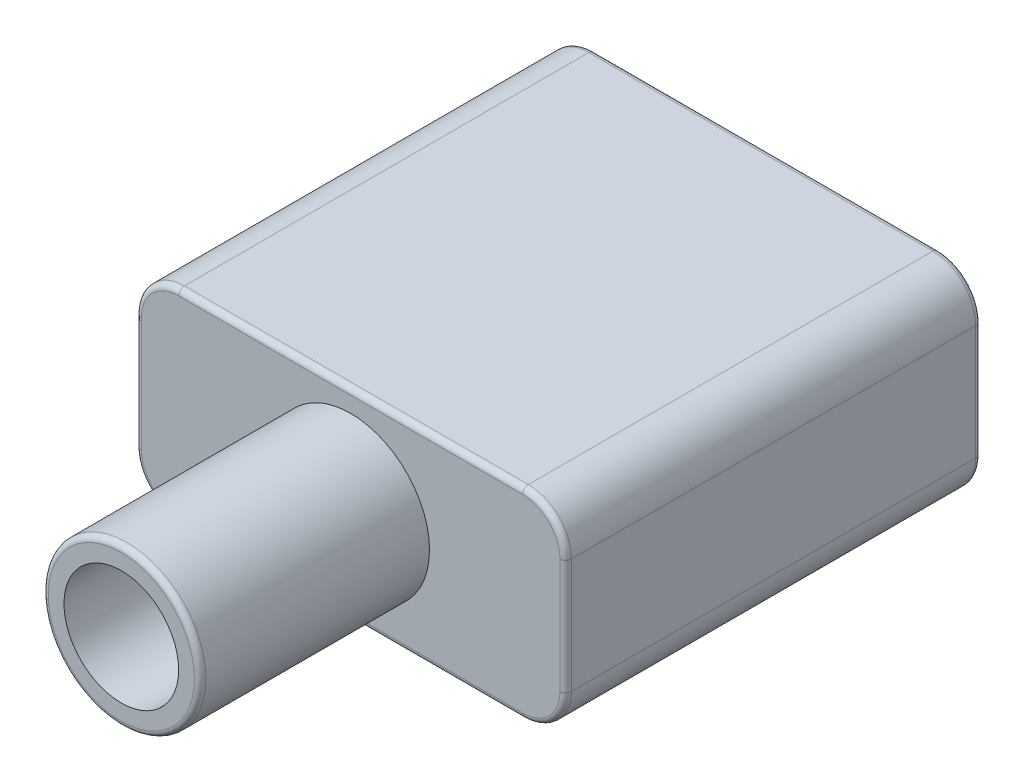
ISO-10303-21;
HEADER;
FILE_DESCRIPTION(('STEP AP214'),'2;1');
FILE_NAME('part.step','',(''),(''),'','','');
FILE_SCHEMA(('AUTOMOTIVE_DESIGN { 1 0 10303 214 1 1 1 1 }'));
ENDSEC;
DATA;
#1=APPLICATION_CONTEXT('core data for automotive mechanical design processes');
#2=APPLICATION_PROTOCOL_DEFINITION('international standard','automotive_design',2000,#1);
#3=PRODUCT_CONTEXT('',#1,'mechanical');
#4=PRODUCT('Part','Part','',(#3));
#5=PRODUCT_RELATED_PRODUCT_CATEGORY('part','',(#4));
#6=PRODUCT_DEFINITION_FORMATION('','',#4);
#7=PRODUCT_DEFINITION_CONTEXT('part definition',#1,'design');
#8=PRODUCT_DEFINITION('design','',#6,#7);
#9=PRODUCT_DEFINITION_SHAPE('','',#8);
#10=(LENGTH_UNIT() NAMED_UNIT(*) SI_UNIT(.MILLI.,.METRE.));
#11=(NAMED_UNIT(*) PLANE_ANGLE_UNIT() SI_UNIT($,.RADIAN.));
#12=(NAMED_UNIT(*) SI_UNIT($,.STERADIAN.) SOLID_ANGLE_UNIT());
#13=UNCERTAINTY_MEASURE_WITH_UNIT(LENGTH_MEASURE(1.E-05),#10,'distance_accuracy_value','');
#14=(GEOMETRIC_REPRESENTATION_CONTEXT(3) GLOBAL_UNCERTAINTY_ASSIGNED_CONTEXT((#13)) GLOBAL_UNIT_ASSIGNED_CONTEXT((#10,
#11,#12)) REPRESENTATION_CONTEXT('',''));
#15=CARTESIAN_POINT('',(0.,0.,0.));
#16=DIRECTION('',(0.,0.,1.));
#17=DIRECTION('',(1.,0.,0.));
#18=AXIS2_PLACEMENT_3D('',#15,#16,#17);
#19=CARTESIAN_POINT('',(7.5,3.5,9.));
#20=DIRECTION('',(0.,0.,-1.));
#21=DIRECTION('',(-1.,0.,0.));
#22=AXIS2_PLACEMENT_3D('',#19,#20,#21);
#23=CYLINDRICAL_SURFACE('',#22,2.);
#24=CARTESIAN_POINT('',(7.5,3.5,9.));
#25=DIRECTION('',(0.,0.,1.));
#26=DIRECTION('',(1.,0.,0.));
#27=AXIS2_PLACEMENT_3D('',#24,#25,#26);
#28=CIRCLE('',#27,2.);
#29=CARTESIAN_POINT('',(9.5,3.5,9.));
#30=VERTEX_POINT('',#29);
#31=EDGE_CURVE('E241',#30,#30,#28,.T.);
#32=ORIENTED_EDGE('',*,*,#31,.T.);
#33=EDGE_LOOP('',(#32));
#34=FACE_BOUND('',#33,.T.);
#35=CARTESIAN_POINT('',(7.5,3.5,0.));
#36=DIRECTION('',(0.,0.,1.));
#37=DIRECTION('',(1.,0.,0.));
#38=AXIS2_PLACEMENT_3D('',#35,#36,#37);
#39=CIRCLE('',#38,2.);
#40=CARTESIAN_POINT('',(9.5,3.5,0.));
#41=VERTEX_POINT('',#40);
#42=EDGE_CURVE('E240',#41,#41,#39,.T.);
#43=ORIENTED_EDGE('',*,*,#42,.F.);
#44=EDGE_LOOP('',(#43));
#45=FACE_BOUND('',#44,.T.);
#46=ADVANCED_FACE('F35',(#34,#45),#23,.F.);
#47=CARTESIAN_POINT('',(7.5,3.5,9.));
#48=DIRECTION('',(0.,0.,-1.));
#49=DIRECTION('',(-1.,0.,0.));
#50=AXIS2_PLACEMENT_3D('',#47,#48,#49);
#51=CYLINDRICAL_SURFACE('',#50,2.75);
#52=CARTESIAN_POINT('',(7.5,3.5,8.8));
#53=DIRECTION('',(0.,0.,1.));
#54=DIRECTION('',(1.,0.,0.));
#55=AXIS2_PLACEMENT_3D('',#52,#53,#54);
#56=CIRCLE('',#55,2.75);
#57=CARTESIAN_POINT('',(10.25,3.5,8.8));
#58=VERTEX_POINT('',#57);
#59=EDGE_CURVE('E11',#58,#58,#56,.F.);
#60=ORIENTED_EDGE('',*,*,#59,.T.);
#61=EDGE_LOOP('',(#60));
#62=FACE_BOUND('',#61,.T.);
#63=CARTESIAN_POINT('',(7.5,3.5,0.999999999999999));
#64=DIRECTION('',(0.,0.,1.));
#65=DIRECTION('',(1.,0.,0.));
#66=AXIS2_PLACEMENT_3D('',#63,#64,#65);
#67=CIRCLE('',#66,2.75);
#68=CARTESIAN_POINT('',(10.25,3.5,0.999999999999999));
#69=VERTEX_POINT('',#68);
#70=EDGE_CURVE('E244',#69,#69,#67,.T.);
#71=ORIENTED_EDGE('',*,*,#70,.T.);
#72=EDGE_LOOP('',(#71));
#73=FACE_BOUND('',#72,.T.);
#74=ADVANCED_FACE('F444',(#62,#73),#51,.T.);
#75=CARTESIAN_POINT('',(0.,0.,9.));
#76=DIRECTION('',(0.,0.,1.));
#77=DIRECTION('',(1.,0.,0.));
#78=AXIS2_PLACEMENT_3D('',#75,#76,#77);
#79=PLANE('',#78);
#80=CARTESIAN_POINT('',(7.5,3.5,9.));
#81=DIRECTION('',(0.,0.,1.));
#82=DIRECTION('',(1.,0.,0.));
#83=AXIS2_PLACEMENT_3D('',#80,#81,#82);
#84=CIRCLE('',#83,2.55);
#85=CARTESIAN_POINT('',(10.05,3.5,9.));
#86=VERTEX_POINT('',#85);
#87=EDGE_CURVE('E44',#86,#86,#84,.T.);
#88=ORIENTED_EDGE('',*,*,#87,.T.);
#89=EDGE_LOOP('',(#88));
#90=FACE_BOUND('',#89,.T.);
#91=ORIENTED_EDGE('',*,*,#31,.F.);
#92=EDGE_LOOP('',(#91));
#93=FACE_BOUND('',#92,.T.);
#94=ADVANCED_FACE('F446',(#90,#93),#79,.T.);
#95=CARTESIAN_POINT('',(0.,0.,0.));
#96=DIRECTION('',(0.,0.,1.));
#97=DIRECTION('',(1.,0.,0.));
#98=AXIS2_PLACEMENT_3D('',#95,#96,#97);
#99=PLANE('',#98);
#100=DIRECTION('',(1.,0.,0.));
#101=VECTOR('',#100,1.);
#102=CARTESIAN_POINT('',(0.,1.15,0.));
#103=LINE('',#102,#101);
#104=CARTESIAN_POINT('',(1.4,1.15,0.));
#105=VERTEX_POINT('',#104);
#106=CARTESIAN_POINT('',(13.6,1.15,0.));
#107=VERTEX_POINT('',#106);
#108=EDGE_CURVE('E199',#105,#107,#103,.T.);
#109=ORIENTED_EDGE('',*,*,#108,.F.);
#110=DIRECTION('',(0.,1.,0.));
#111=VECTOR('',#110,1.);
#112=CARTESIAN_POINT('',(1.4,0.,0.));
#113=LINE('',#112,#111);
#114=CARTESIAN_POINT('',(1.4,5.85,0.));
#115=VERTEX_POINT('',#114);
#116=EDGE_CURVE('E207',#105,#115,#113,.T.);
#117=ORIENTED_EDGE('',*,*,#116,.T.);
#118=DIRECTION('',(1.,0.,0.));
#119=VECTOR('',#118,1.);
#120=CARTESIAN_POINT('',(0.,5.85,0.));
#121=LINE('',#120,#119);
#122=CARTESIAN_POINT('',(13.6,5.85,0.));
#123=VERTEX_POINT('',#122);
#124=EDGE_CURVE('E180',#115,#123,#121,.T.);
#125=ORIENTED_EDGE('',*,*,#124,.T.);
#126=DIRECTION('',(0.,1.,0.));
#127=VECTOR('',#126,1.);
#128=CARTESIAN_POINT('',(13.6,0.,0.));
#129=LINE('',#128,#127);
#130=EDGE_CURVE('E202',#107,#123,#129,.T.);
#131=ORIENTED_EDGE('',*,*,#130,.F.);
#132=EDGE_LOOP('',(#109,#117,#125,#131));
#133=FACE_BOUND('',#132,.T.);
#134=ORIENTED_EDGE('',*,*,#42,.T.);
#135=EDGE_LOOP('',(#134));
#136=FACE_BOUND('',#135,.T.);
#137=ADVANCED_FACE('F453',(#133,#136),#99,.F.);
#138=CARTESIAN_POINT('',(1.5,5.5,1.));
#139=DIRECTION('',(0.,0.,-1.));
#140=DIRECTION('',(-1.,0.,0.));
#141=AXIS2_PLACEMENT_3D('',#138,#139,#140);
#142=CYLINDRICAL_SURFACE('',#141,1.5);
#143=DIRECTION('',(0.,0.,-1.));
#144=VECTOR('',#143,1.);
#145=CARTESIAN_POINT('',(0.,5.49999999999999,1.));
#146=LINE('',#145,#144);
#147=CARTESIAN_POINT('',(0.,5.49999999999999,0.8));
#148=VERTEX_POINT('',#147);
#149=CARTESIAN_POINT('',(0.,5.49999999999999,-13.3));
#150=VERTEX_POINT('',#149);
#151=EDGE_CURVE('E237',#148,#150,#146,.T.);
#152=ORIENTED_EDGE('',*,*,#151,.F.);
#153=CARTESIAN_POINT('',(1.5,5.5,0.8));
#154=DIRECTION('',(0.,0.,1.));
#155=DIRECTION('',(1.,0.,0.));
#156=AXIS2_PLACEMENT_3D('',#153,#154,#155);
#157=CIRCLE('',#156,1.5);
#158=CARTESIAN_POINT('',(1.50000000000001,7.,0.8));
#159=VERTEX_POINT('',#158);
#160=EDGE_CURVE('E278',#148,#159,#157,.F.);
#161=ORIENTED_EDGE('',*,*,#160,.T.);
#162=DIRECTION('',(0.,0.,-1.));
#163=VECTOR('',#162,1.);
#164=CARTESIAN_POINT('',(1.50000000000001,7.,1.));
#165=LINE('',#164,#163);
#166=CARTESIAN_POINT('',(1.50000000000001,7.,-13.3));
#167=VERTEX_POINT('',#166);
#168=EDGE_CURVE('E213',#159,#167,#165,.T.);
#169=ORIENTED_EDGE('',*,*,#168,.T.);
#170=CARTESIAN_POINT('',(1.5,5.5,-13.3));
#171=DIRECTION('',(0.,0.,1.));
#172=DIRECTION('',(1.,0.,0.));
#173=AXIS2_PLACEMENT_3D('',#170,#171,#172);
#174=CIRCLE('',#173,1.5);
#175=EDGE_CURVE('E275',#167,#150,#174,.T.);
#176=ORIENTED_EDGE('',*,*,#175,.T.);
#177=EDGE_LOOP('',(#152,#161,#169,#176));
#178=FACE_BOUND('',#177,.T.);
#179=ADVANCED_FACE('F414',(#178),#142,.T.);
#180=CARTESIAN_POINT('',(0.,0.,1.));
#181=DIRECTION('',(-1.,0.,0.));
#182=DIRECTION('',(0.,0.,1.));
#183=AXIS2_PLACEMENT_3D('',#180,#181,#182);
#184=PLANE('',#183);
#185=DIRECTION('',(0.,0.,-1.));
#186=VECTOR('',#185,1.);
#187=CARTESIAN_POINT('',(0.,1.50000000000001,1.));
#188=LINE('',#187,#186);
#189=CARTESIAN_POINT('',(0.,1.50000000000001,0.8));
#190=VERTEX_POINT('',#189);
#191=CARTESIAN_POINT('',(0.,1.50000000000001,-13.3));
#192=VERTEX_POINT('',#191);
#193=EDGE_CURVE('E234',#190,#192,#188,.T.);
#194=ORIENTED_EDGE('',*,*,#193,.F.);
#195=DIRECTION('',(0.,1.,0.));
#196=VECTOR('',#195,1.);
#197=CARTESIAN_POINT('',(0.,0.,0.8));
#198=LINE('',#197,#196);
#199=EDGE_CURVE('E273',#190,#148,#198,.T.);
#200=ORIENTED_EDGE('',*,*,#199,.T.);
#201=ORIENTED_EDGE('',*,*,#151,.T.);
#202=DIRECTION('',(0.,1.,0.));
#203=VECTOR('',#202,1.);
#204=CARTESIAN_POINT('',(0.,1.50000000000001,-13.3));
#205=LINE('',#204,#203);
#206=EDGE_CURVE('E271',#150,#192,#205,.F.);
#207=ORIENTED_EDGE('',*,*,#206,.T.);
#208=EDGE_LOOP('',(#194,#200,#201,#207));
#209=FACE_BOUND('',#208,.T.);
#210=ADVANCED_FACE('F411',(#209),#184,.T.);
#211=CARTESIAN_POINT('',(1.5,1.5,1.));
#212=DIRECTION('',(0.,0.,-1.));
#213=DIRECTION('',(-1.,0.,0.));
#214=AXIS2_PLACEMENT_3D('',#211,#212,#213);
#215=CYLINDRICAL_SURFACE('',#214,1.5);
#216=DIRECTION('',(0.,0.,-1.));
#217=VECTOR('',#216,1.);
#218=CARTESIAN_POINT('',(1.50000000000001,0.,1.));
#219=LINE('',#218,#217);
#220=CARTESIAN_POINT('',(1.50000000000001,0.,0.8));
#221=VERTEX_POINT('',#220);
#222=CARTESIAN_POINT('',(1.50000000000001,0.,-13.3));
#223=VERTEX_POINT('',#222);
#224=EDGE_CURVE('E231',#221,#223,#219,.T.);
#225=ORIENTED_EDGE('',*,*,#224,.F.);
#226=CARTESIAN_POINT('',(1.5,1.5,0.8));
#227=DIRECTION('',(0.,0.,1.));
#228=DIRECTION('',(1.,0.,0.));
#229=AXIS2_PLACEMENT_3D('',#226,#227,#228);
#230=CIRCLE('',#229,1.5);
#231=EDGE_CURVE('E251',#221,#190,#230,.F.);
#232=ORIENTED_EDGE('',*,*,#231,.T.);
#233=ORIENTED_EDGE('',*,*,#193,.T.);
#234=CARTESIAN_POINT('',(1.5,1.5,-13.3));
#235=DIRECTION('',(0.,0.,1.));
#236=DIRECTION('',(1.,0.,0.));
#237=AXIS2_PLACEMENT_3D('',#234,#235,#236);
#238=CIRCLE('',#237,1.5);
#239=EDGE_CURVE('E249',#192,#223,#238,.T.);
#240=ORIENTED_EDGE('',*,*,#239,.T.);
#241=EDGE_LOOP('',(#225,#232,#233,#240));
#242=FACE_BOUND('',#241,.T.);
#243=ADVANCED_FACE('F393',(#242),#215,.T.);
#244=CARTESIAN_POINT('',(0.,0.,1.));
#245=DIRECTION('',(0.,1.,0.));
#246=DIRECTION('',(-1.,0.,0.));
#247=AXIS2_PLACEMENT_3D('',#244,#245,#246);
#248=PLANE('',#247);
#249=ORIENTED_EDGE('',*,*,#224,.T.);
#250=DIRECTION('',(1.,0.,0.));
#251=VECTOR('',#250,1.);
#252=CARTESIAN_POINT('',(0.,0.,-13.3));
#253=LINE('',#252,#251);
#254=CARTESIAN_POINT('',(13.5,0.,-13.3));
#255=VERTEX_POINT('',#254);
#256=EDGE_CURVE('E312',#223,#255,#253,.T.);
#257=ORIENTED_EDGE('',*,*,#256,.T.);
#258=DIRECTION('',(0.,0.,-1.));
#259=VECTOR('',#258,1.);
#260=CARTESIAN_POINT('',(13.5,0.,1.));
#261=LINE('',#260,#259);
#262=CARTESIAN_POINT('',(13.5,0.,0.8));
#263=VERTEX_POINT('',#262);
#264=EDGE_CURVE('E228',#263,#255,#261,.T.);
#265=ORIENTED_EDGE('',*,*,#264,.F.);
#266=DIRECTION('',(1.,0.,0.));
#267=VECTOR('',#266,1.);
#268=CARTESIAN_POINT('',(1.50000000000001,0.,0.8));
#269=LINE('',#268,#267);
#270=EDGE_CURVE('E310',#263,#221,#269,.F.);
#271=ORIENTED_EDGE('',*,*,#270,.T.);
#272=EDGE_LOOP('',(#249,#257,#265,#271));
#273=FACE_BOUND('',#272,.T.);
#274=ADVANCED_FACE('F389',(#273),#248,.F.);
#275=CARTESIAN_POINT('',(13.5,1.5,1.));
#276=DIRECTION('',(0.,0.,-1.));
#277=DIRECTION('',(-1.,0.,0.));
#278=AXIS2_PLACEMENT_3D('',#275,#276,#277);
#279=CYLINDRICAL_SURFACE('',#278,1.5);
#280=DIRECTION('',(0.,0.,-1.));
#281=VECTOR('',#280,1.);
#282=CARTESIAN_POINT('',(15.,1.50000000000001,1.));
#283=LINE('',#282,#281);
#284=CARTESIAN_POINT('',(15.,1.50000000000001,0.8));
#285=VERTEX_POINT('',#284);
#286=CARTESIAN_POINT('',(15.,1.50000000000001,-13.3));
#287=VERTEX_POINT('',#286);
#288=EDGE_CURVE('E225',#285,#287,#283,.T.);
#289=ORIENTED_EDGE('',*,*,#288,.F.);
#290=CARTESIAN_POINT('',(13.5,1.5,0.8));
#291=DIRECTION('',(0.,0.,1.));
#292=DIRECTION('',(1.,0.,0.));
#293=AXIS2_PLACEMENT_3D('',#290,#291,#292);
#294=CIRCLE('',#293,1.5);
#295=EDGE_CURVE('E294',#285,#263,#294,.F.);
#296=ORIENTED_EDGE('',*,*,#295,.T.);
#297=ORIENTED_EDGE('',*,*,#264,.T.);
#298=CARTESIAN_POINT('',(13.5,1.5,-13.3));
#299=DIRECTION('',(0.,0.,1.));
#300=DIRECTION('',(1.,0.,0.));
#301=AXIS2_PLACEMENT_3D('',#298,#299,#300);
#302=CIRCLE('',#301,1.5);
#303=EDGE_CURVE('E292',#255,#287,#302,.T.);
#304=ORIENTED_EDGE('',*,*,#303,.T.);
#305=EDGE_LOOP('',(#289,#296,#297,#304));
#306=FACE_BOUND('',#305,.T.);
#307=ADVANCED_FACE('F371',(#306),#279,.T.);
#308=CARTESIAN_POINT('',(15.,0.,1.));
#309=DIRECTION('',(-1.,0.,0.));
#310=DIRECTION('',(0.,0.,1.));
#311=AXIS2_PLACEMENT_3D('',#308,#309,#310);
#312=PLANE('',#311);
#313=DIRECTION('',(0.,0.,-1.));
#314=VECTOR('',#313,1.);
#315=CARTESIAN_POINT('',(15.,5.49999999999999,1.));
#316=LINE('',#315,#314);
#317=CARTESIAN_POINT('',(15.,5.49999999999999,0.8));
#318=VERTEX_POINT('',#317);
#319=CARTESIAN_POINT('',(15.,5.49999999999999,-13.3));
#320=VERTEX_POINT('',#319);
#321=EDGE_CURVE('E222',#318,#320,#316,.T.);
#322=ORIENTED_EDGE('',*,*,#321,.F.);
#323=DIRECTION('',(0.,1.,0.));
#324=VECTOR('',#323,1.);
#325=CARTESIAN_POINT('',(15.,1.50000000000001,0.8));
#326=LINE('',#325,#324);
#327=EDGE_CURVE('E290',#318,#285,#326,.F.);
#328=ORIENTED_EDGE('',*,*,#327,.T.);
#329=ORIENTED_EDGE('',*,*,#288,.T.);
#330=DIRECTION('',(0.,1.,0.));
#331=VECTOR('',#330,1.);
#332=CARTESIAN_POINT('',(15.,0.,-13.3));
#333=LINE('',#332,#331);
#334=EDGE_CURVE('E288',#287,#320,#333,.T.);
#335=ORIENTED_EDGE('',*,*,#334,.T.);
#336=EDGE_LOOP('',(#322,#328,#329,#335));
#337=FACE_BOUND('',#336,.T.);
#338=ADVANCED_FACE('F376',(#337),#312,.F.);
#339=CARTESIAN_POINT('',(13.5,5.5,1.));
#340=DIRECTION('',(0.,0.,-1.));
#341=DIRECTION('',(-1.,0.,0.));
#342=AXIS2_PLACEMENT_3D('',#339,#340,#341);
#343=CYLINDRICAL_SURFACE('',#342,1.5);
#344=DIRECTION('',(0.,0.,-1.));
#345=VECTOR('',#344,1.);
#346=CARTESIAN_POINT('',(13.5,7.,1.));
#347=LINE('',#346,#345);
#348=CARTESIAN_POINT('',(13.5,7.,0.8));
#349=VERTEX_POINT('',#348);
#350=CARTESIAN_POINT('',(13.5,7.,-13.3));
#351=VERTEX_POINT('',#350);
#352=EDGE_CURVE('E219',#349,#351,#347,.T.);
#353=ORIENTED_EDGE('',*,*,#352,.F.);
#354=CARTESIAN_POINT('',(13.5,5.5,0.8));
#355=DIRECTION('',(0.,0.,1.));
#356=DIRECTION('',(1.,0.,0.));
#357=AXIS2_PLACEMENT_3D('',#354,#355,#356);
#358=CIRCLE('',#357,1.5);
#359=EDGE_CURVE('E286',#349,#318,#358,.F.);
#360=ORIENTED_EDGE('',*,*,#359,.T.);
#361=ORIENTED_EDGE('',*,*,#321,.T.);
#362=CARTESIAN_POINT('',(13.5,5.5,-13.3));
#363=DIRECTION('',(0.,0.,1.));
#364=DIRECTION('',(1.,0.,0.));
#365=AXIS2_PLACEMENT_3D('',#362,#363,#364);
#366=CIRCLE('',#365,1.5);
#367=EDGE_CURVE('E284',#320,#351,#366,.T.);
#368=ORIENTED_EDGE('',*,*,#367,.T.);
#369=EDGE_LOOP('',(#353,#360,#361,#368));
#370=FACE_BOUND('',#369,.T.);
#371=ADVANCED_FACE('F432',(#370),#343,.T.);
#372=CARTESIAN_POINT('',(0.,7.,1.));
#373=DIRECTION('',(0.,1.,0.));
#374=DIRECTION('',(-1.,0.,0.));
#375=AXIS2_PLACEMENT_3D('',#372,#373,#374);
#376=PLANE('',#375);
#377=ORIENTED_EDGE('',*,*,#168,.F.);
#378=DIRECTION('',(1.,0.,0.));
#379=VECTOR('',#378,1.);
#380=CARTESIAN_POINT('',(0.,7.,0.8));
#381=LINE('',#380,#379);
#382=EDGE_CURVE('E282',#159,#349,#381,.T.);
#383=ORIENTED_EDGE('',*,*,#382,.T.);
#384=ORIENTED_EDGE('',*,*,#352,.T.);
#385=DIRECTION('',(1.,0.,0.));
#386=VECTOR('',#385,1.);
#387=CARTESIAN_POINT('',(1.50000000000001,7.,-13.3));
#388=LINE('',#387,#386);
#389=EDGE_CURVE('E280',#351,#167,#388,.F.);
#390=ORIENTED_EDGE('',*,*,#389,.T.);
#391=EDGE_LOOP('',(#377,#383,#384,#390));
#392=FACE_BOUND('',#391,.T.);
#393=ADVANCED_FACE('F428',(#392),#376,.T.);
#394=CARTESIAN_POINT('',(0.,0.,1.));
#395=DIRECTION('',(0.,0.,1.));
#396=DIRECTION('',(1.,0.,0.));
#397=AXIS2_PLACEMENT_3D('',#394,#395,#396);
#398=PLANE('',#397);
#399=DIRECTION('',(0.,1.,0.));
#400=VECTOR('',#399,1.);
#401=CARTESIAN_POINT('',(0.2,0.,1.));
#402=LINE('',#401,#400);
#403=CARTESIAN_POINT('',(0.2,5.49999999999999,1.));
#404=VERTEX_POINT('',#403);
#405=CARTESIAN_POINT('',(0.2,1.50000000000001,1.));
#406=VERTEX_POINT('',#405);
#407=EDGE_CURVE('E266',#404,#406,#402,.F.);
#408=ORIENTED_EDGE('',*,*,#407,.T.);
#409=CARTESIAN_POINT('',(1.5,1.5,1.));
#410=DIRECTION('',(0.,0.,1.));
#411=DIRECTION('',(1.,0.,0.));
#412=AXIS2_PLACEMENT_3D('',#409,#410,#411);
#413=CIRCLE('',#412,1.3);
#414=CARTESIAN_POINT('',(1.50000000000001,0.2,1.));
#415=VERTEX_POINT('',#414);
#416=EDGE_CURVE('E268',#406,#415,#413,.T.);
#417=ORIENTED_EDGE('',*,*,#416,.T.);
#418=DIRECTION('',(1.,0.,0.));
#419=VECTOR('',#418,1.);
#420=CARTESIAN_POINT('',(13.5,0.199999999999999,1.));
#421=LINE('',#420,#419);
#422=CARTESIAN_POINT('',(13.5,0.199999999999999,1.));
#423=VERTEX_POINT('',#422);
#424=EDGE_CURVE('E254',#415,#423,#421,.T.);
#425=ORIENTED_EDGE('',*,*,#424,.T.);
#426=CARTESIAN_POINT('',(13.5,1.5,1.));
#427=DIRECTION('',(0.,0.,1.));
#428=DIRECTION('',(1.,0.,0.));
#429=AXIS2_PLACEMENT_3D('',#426,#427,#428);
#430=CIRCLE('',#429,1.3);
#431=CARTESIAN_POINT('',(14.8,1.50000000000001,1.));
#432=VERTEX_POINT('',#431);
#433=EDGE_CURVE('E256',#423,#432,#430,.T.);
#434=ORIENTED_EDGE('',*,*,#433,.T.);
#435=DIRECTION('',(0.,1.,0.));
#436=VECTOR('',#435,1.);
#437=CARTESIAN_POINT('',(14.8,5.49999999999999,1.));
#438=LINE('',#437,#436);
#439=CARTESIAN_POINT('',(14.8,5.49999999999999,1.));
#440=VERTEX_POINT('',#439);
#441=EDGE_CURVE('E258',#432,#440,#438,.T.);
#442=ORIENTED_EDGE('',*,*,#441,.T.);
#443=CARTESIAN_POINT('',(13.5,5.5,1.));
#444=DIRECTION('',(0.,0.,1.));
#445=DIRECTION('',(1.,0.,0.));
#446=AXIS2_PLACEMENT_3D('',#443,#444,#445);
#447=CIRCLE('',#446,1.3);
#448=CARTESIAN_POINT('',(13.5,6.8,1.));
#449=VERTEX_POINT('',#448);
#450=EDGE_CURVE('E260',#440,#449,#447,.T.);
#451=ORIENTED_EDGE('',*,*,#450,.T.);
#452=DIRECTION('',(1.,0.,0.));
#453=VECTOR('',#452,1.);
#454=CARTESIAN_POINT('',(0.,6.8,1.));
#455=LINE('',#454,#453);
#456=CARTESIAN_POINT('',(1.50000000000001,6.8,1.));
#457=VERTEX_POINT('',#456);
#458=EDGE_CURVE('E262',#449,#457,#455,.F.);
#459=ORIENTED_EDGE('',*,*,#458,.T.);
#460=CARTESIAN_POINT('',(1.5,5.5,1.));
#461=DIRECTION('',(0.,0.,1.));
#462=DIRECTION('',(1.,0.,0.));
#463=AXIS2_PLACEMENT_3D('',#460,#461,#462);
#464=CIRCLE('',#463,1.3);
#465=EDGE_CURVE('E264',#457,#404,#464,.T.);
#466=ORIENTED_EDGE('',*,*,#465,.T.);
#467=EDGE_LOOP('',(#408,#417,#425,#434,#442,#451,#459,#466));
#468=FACE_BOUND('',#467,.T.);
#469=ORIENTED_EDGE('',*,*,#70,.F.);
#470=EDGE_LOOP('',(#469));
#471=FACE_BOUND('',#470,.T.);
#472=ADVANCED_FACE('F438',(#468,#471),#398,.T.);
#473=CARTESIAN_POINT('',(1.4,0.,-13.5));
#474=DIRECTION('',(1.,0.,0.));
#475=DIRECTION('',(0.,0.,-1.));
#476=AXIS2_PLACEMENT_3D('',#473,#474,#475);
#477=PLANE('',#476);
#478=ORIENTED_EDGE('',*,*,#116,.F.);
#479=DIRECTION('',(0.,0.,1.));
#480=VECTOR('',#479,1.);
#481=CARTESIAN_POINT('',(1.4,1.15,-13.5));
#482=LINE('',#481,#480);
#483=CARTESIAN_POINT('',(1.4,1.15,-13.5));
#484=VERTEX_POINT('',#483);
#485=EDGE_CURVE('E197',#484,#105,#482,.T.);
#486=ORIENTED_EDGE('',*,*,#485,.F.);
#487=DIRECTION('',(0.,1.,0.));
#488=VECTOR('',#487,1.);
#489=CARTESIAN_POINT('',(1.4,0.,-13.5));
#490=LINE('',#489,#488);
#491=CARTESIAN_POINT('',(1.4,5.85,-13.5));
#492=VERTEX_POINT('',#491);
#493=EDGE_CURVE('E192',#484,#492,#490,.T.);
#494=ORIENTED_EDGE('',*,*,#493,.T.);
#495=DIRECTION('',(0.,0.,1.));
#496=VECTOR('',#495,1.);
#497=CARTESIAN_POINT('',(1.4,5.85,-13.5));
#498=LINE('',#497,#496);
#499=EDGE_CURVE('E174',#492,#115,#498,.T.);
#500=ORIENTED_EDGE('',*,*,#499,.T.);
#501=EDGE_LOOP('',(#478,#486,#494,#500));
#502=FACE_BOUND('',#501,.T.);
#503=ADVANCED_FACE('F196',(#502),#477,.T.);
#504=CARTESIAN_POINT('',(0.,1.15,-13.5));
#505=DIRECTION('',(0.,-1.,0.));
#506=DIRECTION('',(1.,0.,0.));
#507=AXIS2_PLACEMENT_3D('',#504,#505,#506);
#508=PLANE('',#507);
#509=ORIENTED_EDGE('',*,*,#108,.T.);
#510=DIRECTION('',(0.,0.,1.));
#511=VECTOR('',#510,1.);
#512=CARTESIAN_POINT('',(13.6,1.15,-13.5));
#513=LINE('',#512,#511);
#514=CARTESIAN_POINT('',(13.6,1.15,-13.5));
#515=VERTEX_POINT('',#514);
#516=EDGE_CURVE('E214',#515,#107,#513,.T.);
#517=ORIENTED_EDGE('',*,*,#516,.F.);
#518=DIRECTION('',(1.,0.,0.));
#519=VECTOR('',#518,1.);
#520=CARTESIAN_POINT('',(0.,1.15,-13.5));
#521=LINE('',#520,#519);
#522=EDGE_CURVE('E186',#484,#515,#521,.T.);
#523=ORIENTED_EDGE('',*,*,#522,.F.);
#524=ORIENTED_EDGE('',*,*,#485,.T.);
#525=EDGE_LOOP('',(#509,#517,#523,#524));
#526=FACE_BOUND('',#525,.T.);
#527=ADVANCED_FACE('F720',(#526),#508,.F.);
#528=CARTESIAN_POINT('',(13.6,0.,-13.5));
#529=DIRECTION('',(1.,0.,0.));
#530=DIRECTION('',(0.,1.,0.));
#531=AXIS2_PLACEMENT_3D('',#528,#529,#530);
#532=PLANE('',#531);
#533=ORIENTED_EDGE('',*,*,#130,.T.);
#534=DIRECTION('',(0.,0.,1.));
#535=VECTOR('',#534,1.);
#536=CARTESIAN_POINT('',(13.6,5.85,-13.5));
#537=LINE('',#536,#535);
#538=CARTESIAN_POINT('',(13.6,5.85,-13.5));
#539=VERTEX_POINT('',#538);
#540=EDGE_CURVE('E185',#539,#123,#537,.T.);
#541=ORIENTED_EDGE('',*,*,#540,.F.);
#542=DIRECTION('',(0.,1.,0.));
#543=VECTOR('',#542,1.);
#544=CARTESIAN_POINT('',(13.6,0.,-13.5));
#545=LINE('',#544,#543);
#546=EDGE_CURVE('E193',#515,#539,#545,.T.);
#547=ORIENTED_EDGE('',*,*,#546,.F.);
#548=ORIENTED_EDGE('',*,*,#516,.T.);
#549=EDGE_LOOP('',(#533,#541,#547,#548));
#550=FACE_BOUND('',#549,.T.);
#551=ADVANCED_FACE('F711',(#550),#532,.F.);
#552=CARTESIAN_POINT('',(0.,5.85,-13.5));
#553=DIRECTION('',(0.,-1.,0.));
#554=DIRECTION('',(1.,0.,0.));
#555=AXIS2_PLACEMENT_3D('',#552,#553,#554);
#556=PLANE('',#555);
#557=ORIENTED_EDGE('',*,*,#124,.F.);
#558=ORIENTED_EDGE('',*,*,#499,.F.);
#559=DIRECTION('',(1.,0.,0.));
#560=VECTOR('',#559,1.);
#561=CARTESIAN_POINT('',(0.,5.85,-13.5));
#562=LINE('',#561,#560);
#563=EDGE_CURVE('E178',#492,#539,#562,.T.);
#564=ORIENTED_EDGE('',*,*,#563,.T.);
#565=ORIENTED_EDGE('',*,*,#540,.T.);
#566=EDGE_LOOP('',(#557,#558,#564,#565));
#567=FACE_BOUND('',#566,.T.);
#568=ADVANCED_FACE('F176',(#567),#556,.T.);
#569=CARTESIAN_POINT('',(0.,0.,-13.5));
#570=DIRECTION('',(0.,0.,1.));
#571=DIRECTION('',(1.,0.,0.));
#572=AXIS2_PLACEMENT_3D('',#569,#570,#571);
#573=PLANE('',#572);
#574=DIRECTION('',(0.,1.,0.));
#575=VECTOR('',#574,1.);
#576=CARTESIAN_POINT('',(0.2,5.49999999999999,-13.5));
#577=LINE('',#576,#575);
#578=CARTESIAN_POINT('',(0.2,1.50000000000001,-13.5));
#579=VERTEX_POINT('',#578);
#580=CARTESIAN_POINT('',(0.2,5.49999999999999,-13.5));
#581=VERTEX_POINT('',#580);
#582=EDGE_CURVE('E52',#579,#581,#577,.T.);
#583=ORIENTED_EDGE('',*,*,#582,.T.);
#584=CARTESIAN_POINT('',(1.5,5.5,-13.5));
#585=DIRECTION('',(0.,0.,1.));
#586=DIRECTION('',(1.,0.,0.));
#587=AXIS2_PLACEMENT_3D('',#584,#585,#586);
#588=CIRCLE('',#587,1.3);
#589=CARTESIAN_POINT('',(1.50000000000001,6.8,-13.5));
#590=VERTEX_POINT('',#589);
#591=EDGE_CURVE('E308',#581,#590,#588,.F.);
#592=ORIENTED_EDGE('',*,*,#591,.T.);
#593=DIRECTION('',(1.,0.,0.));
#594=VECTOR('',#593,1.);
#595=CARTESIAN_POINT('',(13.5,6.8,-13.5));
#596=LINE('',#595,#594);
#597=CARTESIAN_POINT('',(13.5,6.8,-13.5));
#598=VERTEX_POINT('',#597);
#599=EDGE_CURVE('E296',#590,#598,#596,.T.);
#600=ORIENTED_EDGE('',*,*,#599,.T.);
#601=CARTESIAN_POINT('',(13.5,5.5,-13.5));
#602=DIRECTION('',(0.,0.,1.));
#603=DIRECTION('',(1.,0.,0.));
#604=AXIS2_PLACEMENT_3D('',#601,#602,#603);
#605=CIRCLE('',#604,1.3);
#606=CARTESIAN_POINT('',(14.8,5.49999999999999,-13.5));
#607=VERTEX_POINT('',#606);
#608=EDGE_CURVE('E298',#598,#607,#605,.F.);
#609=ORIENTED_EDGE('',*,*,#608,.T.);
#610=DIRECTION('',(0.,1.,0.));
#611=VECTOR('',#610,1.);
#612=CARTESIAN_POINT('',(14.8,0.,-13.5));
#613=LINE('',#612,#611);
#614=CARTESIAN_POINT('',(14.8,1.50000000000001,-13.5));
#615=VERTEX_POINT('',#614);
#616=EDGE_CURVE('E300',#607,#615,#613,.F.);
#617=ORIENTED_EDGE('',*,*,#616,.T.);
#618=CARTESIAN_POINT('',(13.5,1.5,-13.5));
#619=DIRECTION('',(0.,0.,1.));
#620=DIRECTION('',(1.,0.,0.));
#621=AXIS2_PLACEMENT_3D('',#618,#619,#620);
#622=CIRCLE('',#621,1.3);
#623=CARTESIAN_POINT('',(13.5,0.199999999999999,-13.5));
#624=VERTEX_POINT('',#623);
#625=EDGE_CURVE('E302',#615,#624,#622,.F.);
#626=ORIENTED_EDGE('',*,*,#625,.T.);
#627=DIRECTION('',(1.,0.,0.));
#628=VECTOR('',#627,1.);
#629=CARTESIAN_POINT('',(0.,0.2,-13.5));
#630=LINE('',#629,#628);
#631=CARTESIAN_POINT('',(1.50000000000001,0.2,-13.5));
#632=VERTEX_POINT('',#631);
#633=EDGE_CURVE('E304',#624,#632,#630,.F.);
#634=ORIENTED_EDGE('',*,*,#633,.T.);
#635=CARTESIAN_POINT('',(1.5,1.5,-13.5));
#636=DIRECTION('',(0.,0.,1.));
#637=DIRECTION('',(1.,0.,0.));
#638=AXIS2_PLACEMENT_3D('',#635,#636,#637);
#639=CIRCLE('',#638,1.3);
#640=EDGE_CURVE('E57',#632,#579,#639,.F.);
#641=ORIENTED_EDGE('',*,*,#640,.T.);
#642=EDGE_LOOP('',(#583,#592,#600,#609,#617,#626,#634,#641));
#643=FACE_BOUND('',#642,.T.);
#644=ORIENTED_EDGE('',*,*,#493,.F.);
#645=ORIENTED_EDGE('',*,*,#522,.T.);
#646=ORIENTED_EDGE('',*,*,#546,.T.);
#647=ORIENTED_EDGE('',*,*,#563,.F.);
#648=EDGE_LOOP('',(#644,#645,#646,#647));
#649=FACE_BOUND('',#648,.T.);
#650=ADVANCED_FACE('F190',(#643,#649),#573,.F.);
#651=CARTESIAN_POINT('',(13.5,5.5,0.8));
#652=DIRECTION('',(0.,0.,1.));
#653=DIRECTION('',(1.,0.,0.));
#654=AXIS2_PLACEMENT_3D('',#651,#652,#653);
#655=TOROIDAL_SURFACE('',#654,1.3,0.2);
#656=CARTESIAN_POINT('',(13.5,6.8,0.8));
#657=DIRECTION('',(-1.,0.,0.));
#658=DIRECTION('',(0.,0.,1.));
#659=AXIS2_PLACEMENT_3D('',#656,#657,#658);
#660=CIRCLE('',#659,0.2);
#661=EDGE_CURVE('E332',#449,#349,#660,.T.);
#662=ORIENTED_EDGE('',*,*,#661,.F.);
#663=ORIENTED_EDGE('',*,*,#450,.F.);
#664=CARTESIAN_POINT('',(14.8,5.49999999999999,0.8));
#665=DIRECTION('',(0.,-1.,0.));
#666=DIRECTION('',(1.,0.,0.));
#667=AXIS2_PLACEMENT_3D('',#664,#665,#666);
#668=CIRCLE('',#667,0.2);
#669=EDGE_CURVE('E209',#318,#440,#668,.T.);
#670=ORIENTED_EDGE('',*,*,#669,.F.);
#671=ORIENTED_EDGE('',*,*,#359,.F.);
#672=EDGE_LOOP('',(#662,#663,#670,#671));
#673=FACE_BOUND('',#672,.T.);
#674=ADVANCED_FACE('F435',(#673),#655,.T.);
#675=CARTESIAN_POINT('',(14.8,0.,0.8));
#676=DIRECTION('',(0.,-1.,0.));
#677=DIRECTION('',(0.,0.,-1.));
#678=AXIS2_PLACEMENT_3D('',#675,#676,#677);
#679=CYLINDRICAL_SURFACE('',#678,0.2);
#680=ORIENTED_EDGE('',*,*,#669,.T.);
#681=ORIENTED_EDGE('',*,*,#441,.F.);
#682=CARTESIAN_POINT('',(14.8,1.50000000000001,0.8));
#683=DIRECTION('',(0.,-1.,0.));
#684=DIRECTION('',(0.,0.,-1.));
#685=AXIS2_PLACEMENT_3D('',#682,#683,#684);
#686=CIRCLE('',#685,0.2);
#687=EDGE_CURVE('E329',#285,#432,#686,.T.);
#688=ORIENTED_EDGE('',*,*,#687,.F.);
#689=ORIENTED_EDGE('',*,*,#327,.F.);
#690=EDGE_LOOP('',(#680,#681,#688,#689));
#691=FACE_BOUND('',#690,.T.);
#692=ADVANCED_FACE('F380',(#691),#679,.T.);
#693=CARTESIAN_POINT('',(0.,6.8,0.8));
#694=DIRECTION('',(1.,0.,0.));
#695=DIRECTION('',(0.,1.,0.));
#696=AXIS2_PLACEMENT_3D('',#693,#694,#695);
#697=CYLINDRICAL_SURFACE('',#696,0.2);
#698=ORIENTED_EDGE('',*,*,#661,.T.);
#699=ORIENTED_EDGE('',*,*,#382,.F.);
#700=CARTESIAN_POINT('',(1.50000000000001,6.8,0.8));
#701=DIRECTION('',(-1.,0.,0.));
#702=DIRECTION('',(0.,-1.,0.));
#703=AXIS2_PLACEMENT_3D('',#700,#701,#702);
#704=CIRCLE('',#703,0.2);
#705=EDGE_CURVE('E326',#457,#159,#704,.T.);
#706=ORIENTED_EDGE('',*,*,#705,.F.);
#707=ORIENTED_EDGE('',*,*,#458,.F.);
#708=EDGE_LOOP('',(#698,#699,#706,#707));
#709=FACE_BOUND('',#708,.T.);
#710=ADVANCED_FACE('F424',(#709),#697,.T.);
#711=CARTESIAN_POINT('',(13.5,1.5,0.8));
#712=DIRECTION('',(0.,0.,1.));
#713=DIRECTION('',(1.,0.,0.));
#714=AXIS2_PLACEMENT_3D('',#711,#712,#713);
#715=TOROIDAL_SURFACE('',#714,1.3,0.2);
#716=ORIENTED_EDGE('',*,*,#687,.T.);
#717=ORIENTED_EDGE('',*,*,#433,.F.);
#718=CARTESIAN_POINT('',(13.5,0.199999999999999,0.8));
#719=DIRECTION('',(-1.,0.,0.));
#720=DIRECTION('',(0.,-1.,0.));
#721=AXIS2_PLACEMENT_3D('',#718,#719,#720);
#722=CIRCLE('',#721,0.2);
#723=EDGE_CURVE('E323',#263,#423,#722,.T.);
#724=ORIENTED_EDGE('',*,*,#723,.F.);
#725=ORIENTED_EDGE('',*,*,#295,.F.);
#726=EDGE_LOOP('',(#716,#717,#724,#725));
#727=FACE_BOUND('',#726,.T.);
#728=ADVANCED_FACE('F386',(#727),#715,.T.);
#729=CARTESIAN_POINT('',(1.5,5.5,0.8));
#730=DIRECTION('',(0.,0.,1.));
#731=DIRECTION('',(1.,0.,0.));
#732=AXIS2_PLACEMENT_3D('',#729,#730,#731);
#733=TOROIDAL_SURFACE('',#732,1.3,0.2);
#734=ORIENTED_EDGE('',*,*,#705,.T.);
#735=ORIENTED_EDGE('',*,*,#160,.F.);
#736=CARTESIAN_POINT('',(0.2,5.49999999999999,0.8));
#737=DIRECTION('',(0.,-1.,0.));
#738=DIRECTION('',(0.,0.,-1.));
#739=AXIS2_PLACEMENT_3D('',#736,#737,#738);
#740=CIRCLE('',#739,0.2);
#741=EDGE_CURVE('E320',#404,#148,#740,.T.);
#742=ORIENTED_EDGE('',*,*,#741,.F.);
#743=ORIENTED_EDGE('',*,*,#465,.F.);
#744=EDGE_LOOP('',(#734,#735,#742,#743));
#745=FACE_BOUND('',#744,.T.);
#746=ADVANCED_FACE('F418',(#745),#733,.T.);
#747=CARTESIAN_POINT('',(0.,0.2,0.8));
#748=DIRECTION('',(-1.,0.,0.));
#749=DIRECTION('',(0.,-1.,0.));
#750=AXIS2_PLACEMENT_3D('',#747,#748,#749);
#751=CYLINDRICAL_SURFACE('',#750,0.2);
#752=ORIENTED_EDGE('',*,*,#723,.T.);
#753=ORIENTED_EDGE('',*,*,#424,.F.);
#754=CARTESIAN_POINT('',(1.50000000000001,0.2,0.8));
#755=DIRECTION('',(-1.,0.,0.));
#756=DIRECTION('',(0.,0.,1.));
#757=AXIS2_PLACEMENT_3D('',#754,#755,#756);
#758=CIRCLE('',#757,0.2);
#759=EDGE_CURVE('E318',#221,#415,#758,.T.);
#760=ORIENTED_EDGE('',*,*,#759,.F.);
#761=ORIENTED_EDGE('',*,*,#270,.F.);
#762=EDGE_LOOP('',(#752,#753,#760,#761));
#763=FACE_BOUND('',#762,.T.);
#764=ADVANCED_FACE('F399',(#763),#751,.T.);
#765=CARTESIAN_POINT('',(0.2,0.,0.8));
#766=DIRECTION('',(0.,1.,0.));
#767=DIRECTION('',(0.,0.,1.));
#768=AXIS2_PLACEMENT_3D('',#765,#766,#767);
#769=CYLINDRICAL_SURFACE('',#768,0.2);
#770=ORIENTED_EDGE('',*,*,#741,.T.);
#771=ORIENTED_EDGE('',*,*,#199,.F.);
#772=CARTESIAN_POINT('',(0.2,1.50000000000001,0.8));
#773=DIRECTION('',(0.,-1.,0.));
#774=DIRECTION('',(1.,0.,0.));
#775=AXIS2_PLACEMENT_3D('',#772,#773,#774);
#776=CIRCLE('',#775,0.2);
#777=EDGE_CURVE('E316',#406,#190,#776,.T.);
#778=ORIENTED_EDGE('',*,*,#777,.F.);
#779=ORIENTED_EDGE('',*,*,#407,.F.);
#780=EDGE_LOOP('',(#770,#771,#778,#779));
#781=FACE_BOUND('',#780,.T.);
#782=ADVANCED_FACE('F407',(#781),#769,.T.);
#783=CARTESIAN_POINT('',(1.5,1.5,0.8));
#784=DIRECTION('',(0.,0.,1.));
#785=DIRECTION('',(1.,0.,0.));
#786=AXIS2_PLACEMENT_3D('',#783,#784,#785);
#787=TOROIDAL_SURFACE('',#786,1.3,0.2);
#788=ORIENTED_EDGE('',*,*,#759,.T.);
#789=ORIENTED_EDGE('',*,*,#416,.F.);
#790=ORIENTED_EDGE('',*,*,#777,.T.);
#791=ORIENTED_EDGE('',*,*,#231,.F.);
#792=EDGE_LOOP('',(#788,#789,#790,#791));
#793=FACE_BOUND('',#792,.T.);
#794=ADVANCED_FACE('F402',(#793),#787,.T.);
#795=CARTESIAN_POINT('',(13.5,1.5,-13.3));
#796=DIRECTION('',(0.,0.,1.));
#797=DIRECTION('',(1.,0.,0.));
#798=AXIS2_PLACEMENT_3D('',#795,#796,#797);
#799=TOROIDAL_SURFACE('',#798,1.3,0.2);
#800=CARTESIAN_POINT('',(14.8,1.50000000000001,-13.3));
#801=DIRECTION('',(0.,1.,0.));
#802=DIRECTION('',(-1.,0.,0.));
#803=AXIS2_PLACEMENT_3D('',#800,#801,#802);
#804=CIRCLE('',#803,0.2);
#805=EDGE_CURVE('E352',#287,#615,#804,.T.);
#806=ORIENTED_EDGE('',*,*,#805,.F.);
#807=ORIENTED_EDGE('',*,*,#303,.F.);
#808=CARTESIAN_POINT('',(13.5,0.199999999999999,-13.3));
#809=DIRECTION('',(-1.,0.,0.));
#810=DIRECTION('',(0.,0.,1.));
#811=AXIS2_PLACEMENT_3D('',#808,#809,#810);
#812=CIRCLE('',#811,0.2);
#813=EDGE_CURVE('E39',#624,#255,#812,.T.);
#814=ORIENTED_EDGE('',*,*,#813,.F.);
#815=ORIENTED_EDGE('',*,*,#625,.F.);
#816=EDGE_LOOP('',(#806,#807,#814,#815));
#817=FACE_BOUND('',#816,.T.);
#818=ADVANCED_FACE('F368',(#817),#799,.T.);
#819=CARTESIAN_POINT('',(0.,0.2,-13.3));
#820=DIRECTION('',(1.,0.,0.));
#821=DIRECTION('',(0.,1.,0.));
#822=AXIS2_PLACEMENT_3D('',#819,#820,#821);
#823=CYLINDRICAL_SURFACE('',#822,0.2);
#824=ORIENTED_EDGE('',*,*,#813,.T.);
#825=ORIENTED_EDGE('',*,*,#256,.F.);
#826=CARTESIAN_POINT('',(1.50000000000001,0.2,-13.3));
#827=DIRECTION('',(-1.,0.,0.));
#828=DIRECTION('',(0.,-1.,0.));
#829=AXIS2_PLACEMENT_3D('',#826,#827,#828);
#830=CIRCLE('',#829,0.2);
#831=EDGE_CURVE('E350',#632,#223,#830,.T.);
#832=ORIENTED_EDGE('',*,*,#831,.F.);
#833=ORIENTED_EDGE('',*,*,#633,.F.);
#834=EDGE_LOOP('',(#824,#825,#832,#833));
#835=FACE_BOUND('',#834,.T.);
#836=ADVANCED_FACE('F363',(#835),#823,.T.);
#837=CARTESIAN_POINT('',(14.8,0.,-13.3));
#838=DIRECTION('',(0.,1.,0.));
#839=DIRECTION('',(0.,0.,1.));
#840=AXIS2_PLACEMENT_3D('',#837,#838,#839);
#841=CYLINDRICAL_SURFACE('',#840,0.2);
#842=ORIENTED_EDGE('',*,*,#805,.T.);
#843=ORIENTED_EDGE('',*,*,#616,.F.);
#844=CARTESIAN_POINT('',(14.8,5.49999999999999,-13.3));
#845=DIRECTION('',(0.,1.,0.));
#846=DIRECTION('',(0.,0.,1.));
#847=AXIS2_PLACEMENT_3D('',#844,#845,#846);
#848=CIRCLE('',#847,0.2);
#849=EDGE_CURVE('E347',#320,#607,#848,.T.);
#850=ORIENTED_EDGE('',*,*,#849,.F.);
#851=ORIENTED_EDGE('',*,*,#334,.F.);
#852=EDGE_LOOP('',(#842,#843,#850,#851));
#853=FACE_BOUND('',#852,.T.);
#854=ADVANCED_FACE('F495',(#853),#841,.T.);
#855=CARTESIAN_POINT('',(1.5,1.5,-13.3));
#856=DIRECTION('',(0.,0.,1.));
#857=DIRECTION('',(1.,0.,0.));
#858=AXIS2_PLACEMENT_3D('',#855,#856,#857);
#859=TOROIDAL_SURFACE('',#858,1.3,0.2);
#860=ORIENTED_EDGE('',*,*,#831,.T.);
#861=ORIENTED_EDGE('',*,*,#239,.F.);
#862=CARTESIAN_POINT('',(0.2,1.50000000000001,-13.3));
#863=DIRECTION('',(0.,1.,0.));
#864=DIRECTION('',(0.,0.,1.));
#865=AXIS2_PLACEMENT_3D('',#862,#863,#864);
#866=CIRCLE('',#865,0.2);
#867=EDGE_CURVE('E344',#579,#192,#866,.T.);
#868=ORIENTED_EDGE('',*,*,#867,.F.);
#869=ORIENTED_EDGE('',*,*,#640,.F.);
#870=EDGE_LOOP('',(#860,#861,#868,#869));
#871=FACE_BOUND('',#870,.T.);
#872=ADVANCED_FACE('F491',(#871),#859,.T.);
#873=CARTESIAN_POINT('',(13.5,5.5,-13.3));
#874=DIRECTION('',(0.,0.,1.));
#875=DIRECTION('',(1.,0.,0.));
#876=AXIS2_PLACEMENT_3D('',#873,#874,#875);
#877=TOROIDAL_SURFACE('',#876,1.3,0.2);
#878=ORIENTED_EDGE('',*,*,#849,.T.);
#879=ORIENTED_EDGE('',*,*,#608,.F.);
#880=CARTESIAN_POINT('',(13.5,6.8,-13.3));
#881=DIRECTION('',(-1.,0.,0.));
#882=DIRECTION('',(0.,-1.,0.));
#883=AXIS2_PLACEMENT_3D('',#880,#881,#882);
#884=CIRCLE('',#883,0.2);
#885=EDGE_CURVE('E341',#351,#598,#884,.T.);
#886=ORIENTED_EDGE('',*,*,#885,.F.);
#887=ORIENTED_EDGE('',*,*,#367,.F.);
#888=EDGE_LOOP('',(#878,#879,#886,#887));
#889=FACE_BOUND('',#888,.T.);
#890=ADVANCED_FACE('F487',(#889),#877,.T.);
#891=CARTESIAN_POINT('',(0.2,0.,-13.3));
#892=DIRECTION('',(0.,-1.,0.));
#893=DIRECTION('',(0.,0.,-1.));
#894=AXIS2_PLACEMENT_3D('',#891,#892,#893);
#895=CYLINDRICAL_SURFACE('',#894,0.2);
#896=ORIENTED_EDGE('',*,*,#867,.T.);
#897=ORIENTED_EDGE('',*,*,#206,.F.);
#898=CARTESIAN_POINT('',(0.2,5.49999999999999,-13.3));
#899=DIRECTION('',(0.,1.,0.));
#900=DIRECTION('',(-1.,0.,0.));
#901=AXIS2_PLACEMENT_3D('',#898,#899,#900);
#902=CIRCLE('',#901,0.2);
#903=EDGE_CURVE('E339',#581,#150,#902,.T.);
#904=ORIENTED_EDGE('',*,*,#903,.F.);
#905=ORIENTED_EDGE('',*,*,#582,.F.);
#906=EDGE_LOOP('',(#896,#897,#904,#905));
#907=FACE_BOUND('',#906,.T.);
#908=ADVANCED_FACE('F483',(#907),#895,.T.);
#909=CARTESIAN_POINT('',(0.,6.8,-13.3));
#910=DIRECTION('',(-1.,0.,0.));
#911=DIRECTION('',(0.,-1.,0.));
#912=AXIS2_PLACEMENT_3D('',#909,#910,#911);
#913=CYLINDRICAL_SURFACE('',#912,0.2);
#914=ORIENTED_EDGE('',*,*,#885,.T.);
#915=ORIENTED_EDGE('',*,*,#599,.F.);
#916=CARTESIAN_POINT('',(1.50000000000001,6.8,-13.3));
#917=DIRECTION('',(-1.,0.,0.));
#918=DIRECTION('',(0.,0.,1.));
#919=AXIS2_PLACEMENT_3D('',#916,#917,#918);
#920=CIRCLE('',#919,0.2);
#921=EDGE_CURVE('E337',#167,#590,#920,.T.);
#922=ORIENTED_EDGE('',*,*,#921,.F.);
#923=ORIENTED_EDGE('',*,*,#389,.F.);
#924=EDGE_LOOP('',(#914,#915,#922,#923));
#925=FACE_BOUND('',#924,.T.);
#926=ADVANCED_FACE('F479',(#925),#913,.T.);
#927=CARTESIAN_POINT('',(1.5,5.5,-13.3));
#928=DIRECTION('',(0.,0.,1.));
#929=DIRECTION('',(1.,0.,0.));
#930=AXIS2_PLACEMENT_3D('',#927,#928,#929);
#931=TOROIDAL_SURFACE('',#930,1.3,0.2);
#932=ORIENTED_EDGE('',*,*,#903,.T.);
#933=ORIENTED_EDGE('',*,*,#175,.F.);
#934=ORIENTED_EDGE('',*,*,#921,.T.);
#935=ORIENTED_EDGE('',*,*,#591,.F.);
#936=EDGE_LOOP('',(#932,#933,#934,#935));
#937=FACE_BOUND('',#936,.T.);
#938=ADVANCED_FACE('F476',(#937),#931,.T.);
#939=CARTESIAN_POINT('',(7.5,3.5,8.8));
#940=DIRECTION('',(0.,0.,1.));
#941=DIRECTION('',(1.,0.,0.));
#942=AXIS2_PLACEMENT_3D('',#939,#940,#941);
#943=TOROIDAL_SURFACE('',#942,2.55,0.2);
#944=ORIENTED_EDGE('',*,*,#59,.F.);
#945=EDGE_LOOP('',(#944));
#946=FACE_BOUND('',#945,.T.);
#947=ORIENTED_EDGE('',*,*,#87,.F.);
#948=EDGE_LOOP('',(#947));
#949=FACE_BOUND('',#948,.T.);
#950=ADVANCED_FACE('F37',(#946,#949),#943,.T.);
#951=CLOSED_SHELL('',(#46,#74,#94,#137,#179,#210,#243,#274,#307,#338,#371,#393,#472,#503,#527,
#551,#568,#650,#674,#692,#710,#728,#746,#764,#782,#794,#818,#836,#854,#872,#890,#908,#926,#938,#950));
#952=MANIFOLD_SOLID_BREP('B2',#951);
#953=ADVANCED_BREP_SHAPE_REPRESENTATION('',(#18,#952),#14);
#954=SHAPE_DEFINITION_REPRESENTATION(#9,#953);
ENDSEC;
END-ISO-10303-21;
